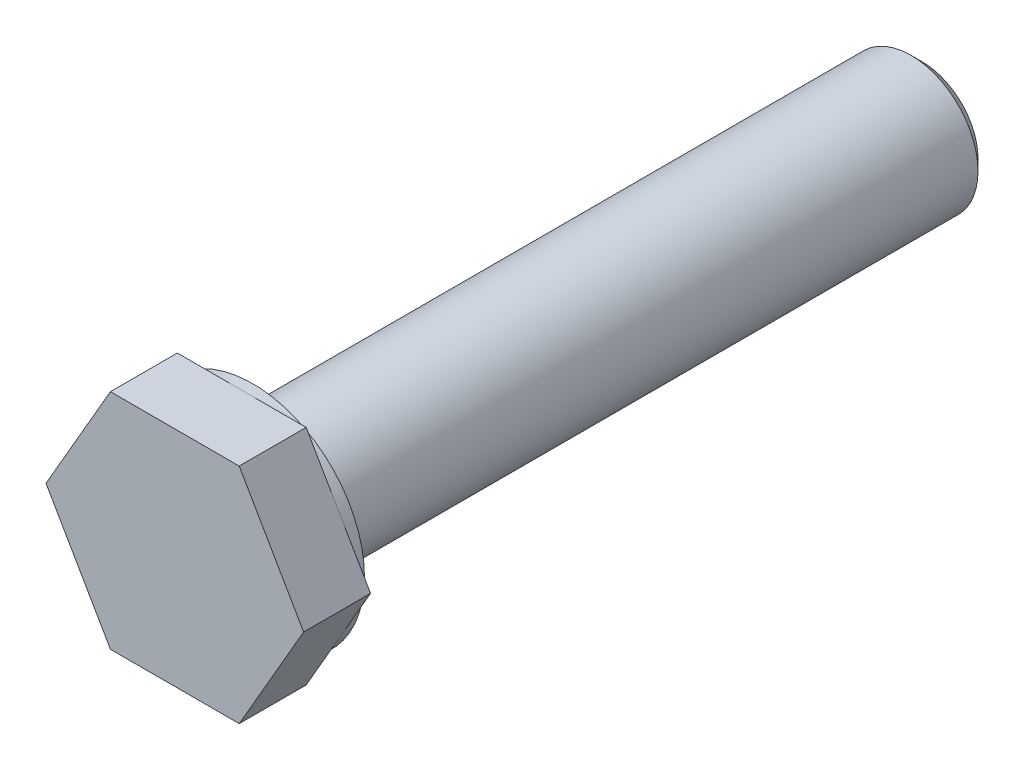
ISO-10303-21;
HEADER;
FILE_DESCRIPTION(('STEP AP214'),'2;1');
FILE_NAME('part.step','',(''),(''),'','','');
FILE_SCHEMA(('AUTOMOTIVE_DESIGN { 1 0 10303 214 1 1 1 1 }'));
ENDSEC;
DATA;
#1=APPLICATION_CONTEXT('core data for automotive mechanical design processes');
#2=APPLICATION_PROTOCOL_DEFINITION('international standard','automotive_design',2000,#1);
#3=PRODUCT_CONTEXT('',#1,'mechanical');
#4=PRODUCT('Part','Part','',(#3));
#5=PRODUCT_RELATED_PRODUCT_CATEGORY('part','',(#4));
#6=PRODUCT_DEFINITION_FORMATION('','',#4);
#7=PRODUCT_DEFINITION_CONTEXT('part definition',#1,'design');
#8=PRODUCT_DEFINITION('design','',#6,#7);
#9=PRODUCT_DEFINITION_SHAPE('','',#8);
#10=(LENGTH_UNIT() NAMED_UNIT(*) SI_UNIT(.MILLI.,.METRE.));
#11=(NAMED_UNIT(*) PLANE_ANGLE_UNIT() SI_UNIT($,.RADIAN.));
#12=(NAMED_UNIT(*) SI_UNIT($,.STERADIAN.) SOLID_ANGLE_UNIT());
#13=UNCERTAINTY_MEASURE_WITH_UNIT(LENGTH_MEASURE(1.E-05),#10,'distance_accuracy_value','');
#14=(GEOMETRIC_REPRESENTATION_CONTEXT(3) GLOBAL_UNCERTAINTY_ASSIGNED_CONTEXT((#13)) GLOBAL_UNIT_ASSIGNED_CONTEXT((#10,
#11,#12)) REPRESENTATION_CONTEXT('',''));
#15=CARTESIAN_POINT('',(0.,0.,0.));
#16=DIRECTION('',(0.,0.,1.));
#17=DIRECTION('',(1.,0.,0.));
#18=AXIS2_PLACEMENT_3D('',#15,#16,#17);
#19=CARTESIAN_POINT('',(0.,0.,30.));
#20=DIRECTION('',(0.,0.,-1.));
#21=DIRECTION('',(-1.,0.,0.));
#22=AXIS2_PLACEMENT_3D('',#19,#20,#21);
#23=CYLINDRICAL_SURFACE('',#22,3.);
#24=CARTESIAN_POINT('',(0.,0.,29.75));
#25=DIRECTION('',(0.,0.,1.));
#26=DIRECTION('',(1.,0.,0.));
#27=AXIS2_PLACEMENT_3D('',#24,#25,#26);
#28=CIRCLE('',#27,3.);
#29=CARTESIAN_POINT('',(3.,0.,29.75));
#30=VERTEX_POINT('',#29);
#31=EDGE_CURVE('E11',#30,#30,#28,.F.);
#32=ORIENTED_EDGE('',*,*,#31,.T.);
#33=EDGE_LOOP('',(#32));
#34=FACE_BOUND('',#33,.T.);
#35=CARTESIAN_POINT('',(0.,0.,0.5));
#36=DIRECTION('',(0.,0.,1.));
#37=DIRECTION('',(1.,0.,0.));
#38=AXIS2_PLACEMENT_3D('',#35,#36,#37);
#39=CIRCLE('',#38,3.);
#40=CARTESIAN_POINT('',(3.,0.,0.5));
#41=VERTEX_POINT('',#40);
#42=EDGE_CURVE('E155',#41,#41,#39,.T.);
#43=ORIENTED_EDGE('',*,*,#42,.T.);
#44=EDGE_LOOP('',(#43));
#45=FACE_BOUND('',#44,.T.);
#46=ADVANCED_FACE('F41',(#34,#45),#23,.T.);
#47=CARTESIAN_POINT('',(0.,0.,0.));
#48=DIRECTION('',(0.,0.,1.));
#49=DIRECTION('',(1.,0.,0.));
#50=AXIS2_PLACEMENT_3D('',#47,#48,#49);
#51=PLANE('',#50);
#52=CARTESIAN_POINT('',(0.,0.,0.));
#53=DIRECTION('',(0.,0.,1.));
#54=DIRECTION('',(1.,0.,0.));
#55=AXIS2_PLACEMENT_3D('',#52,#53,#54);
#56=CIRCLE('',#55,2.5);
#57=CARTESIAN_POINT('',(2.5,0.,0.));
#58=VERTEX_POINT('',#57);
#59=EDGE_CURVE('E161',#58,#58,#56,.F.);
#60=ORIENTED_EDGE('',*,*,#59,.T.);
#61=EDGE_LOOP('',(#60));
#62=FACE_BOUND('',#61,.T.);
#63=ADVANCED_FACE('F180',(#62),#51,.F.);
#64=CARTESIAN_POINT('',(0.,0.,30.5));
#65=DIRECTION('',(0.,0.,-1.));
#66=DIRECTION('',(-1.,0.,0.));
#67=AXIS2_PLACEMENT_3D('',#64,#65,#66);
#68=CYLINDRICAL_SURFACE('',#67,5.);
#69=CARTESIAN_POINT('',(0.,0.,30.5));
#70=DIRECTION('',(0.,0.,1.));
#71=DIRECTION('',(1.,0.,0.));
#72=AXIS2_PLACEMENT_3D('',#69,#70,#71);
#73=CIRCLE('',#72,5.);
#74=CARTESIAN_POINT('',(4.33012701892219,2.5,30.5));
#75=VERTEX_POINT('',#74);
#76=CARTESIAN_POINT('',(0.,5.,30.5));
#77=VERTEX_POINT('',#76);
#78=EDGE_CURVE('E152',#75,#77,#73,.T.);
#79=ORIENTED_EDGE('',*,*,#78,.F.);
#80=CARTESIAN_POINT('',(4.33012701892219,-2.5,30.5));
#81=VERTEX_POINT('',#80);
#82=EDGE_CURVE('E58',#81,#75,#73,.T.);
#83=ORIENTED_EDGE('',*,*,#82,.F.);
#84=CARTESIAN_POINT('',(0.,-5.,30.5));
#85=VERTEX_POINT('',#84);
#86=EDGE_CURVE('E62',#85,#81,#73,.T.);
#87=ORIENTED_EDGE('',*,*,#86,.F.);
#88=CARTESIAN_POINT('',(-4.3301270189222,-2.5,30.5));
#89=VERTEX_POINT('',#88);
#90=EDGE_CURVE('E421',#89,#85,#73,.T.);
#91=ORIENTED_EDGE('',*,*,#90,.F.);
#92=CARTESIAN_POINT('',(-4.3301270189222,2.5,30.5));
#93=VERTEX_POINT('',#92);
#94=EDGE_CURVE('E399',#93,#89,#73,.T.);
#95=ORIENTED_EDGE('',*,*,#94,.F.);
#96=EDGE_CURVE('E156',#77,#93,#73,.T.);
#97=ORIENTED_EDGE('',*,*,#96,.F.);
#98=EDGE_LOOP('',(#79,#83,#87,#91,#95,#97));
#99=FACE_BOUND('',#98,.T.);
#100=CARTESIAN_POINT('',(0.,0.,30.));
#101=DIRECTION('',(0.,0.,1.));
#102=DIRECTION('',(1.,0.,0.));
#103=AXIS2_PLACEMENT_3D('',#100,#101,#102);
#104=CIRCLE('',#103,5.);
#105=CARTESIAN_POINT('',(5.,0.,30.));
#106=VERTEX_POINT('',#105);
#107=EDGE_CURVE('E142',#106,#106,#104,.T.);
#108=ORIENTED_EDGE('',*,*,#107,.T.);
#109=EDGE_LOOP('',(#108));
#110=FACE_BOUND('',#109,.T.);
#111=ADVANCED_FACE('F186',(#99,#110),#68,.T.);
#112=CARTESIAN_POINT('',(0.,0.,30.));
#113=DIRECTION('',(0.,0.,1.));
#114=DIRECTION('',(1.,0.,0.));
#115=AXIS2_PLACEMENT_3D('',#112,#113,#114);
#116=PLANE('',#115);
#117=CARTESIAN_POINT('',(0.,0.,30.));
#118=DIRECTION('',(0.,0.,1.));
#119=DIRECTION('',(1.,0.,0.));
#120=AXIS2_PLACEMENT_3D('',#117,#118,#119);
#121=CIRCLE('',#120,3.25000000000001);
#122=CARTESIAN_POINT('',(3.25000000000001,0.,30.));
#123=VERTEX_POINT('',#122);
#124=EDGE_CURVE('E51',#123,#123,#121,.T.);
#125=ORIENTED_EDGE('',*,*,#124,.T.);
#126=EDGE_LOOP('',(#125));
#127=FACE_BOUND('',#126,.T.);
#128=ORIENTED_EDGE('',*,*,#107,.F.);
#129=EDGE_LOOP('',(#128));
#130=FACE_BOUND('',#129,.T.);
#131=ADVANCED_FACE('F168',(#127,#130),#116,.F.);
#132=CARTESIAN_POINT('',(0.,0.,30.5));
#133=DIRECTION('',(0.,0.,1.));
#134=DIRECTION('',(1.,0.,0.));
#135=AXIS2_PLACEMENT_3D('',#132,#133,#134);
#136=PLANE('',#135);
#137=DIRECTION('',(-0.5,0.866025403784438,0.));
#138=VECTOR('',#137,1.);
#139=CARTESIAN_POINT('',(5.77350269189626,0.,30.5));
#140=LINE('',#139,#138);
#141=CARTESIAN_POINT('',(2.88675134594813,5.,30.5));
#142=VERTEX_POINT('',#141);
#143=EDGE_CURVE('E353',#75,#142,#140,.T.);
#144=ORIENTED_EDGE('',*,*,#143,.F.);
#145=ORIENTED_EDGE('',*,*,#78,.T.);
#146=DIRECTION('',(-1.,0.,0.));
#147=VECTOR('',#146,1.);
#148=CARTESIAN_POINT('',(2.88675134594813,5.,30.5));
#149=LINE('',#148,#147);
#150=EDGE_CURVE('E361',#142,#77,#149,.T.);
#151=ORIENTED_EDGE('',*,*,#150,.F.);
#152=EDGE_LOOP('',(#144,#145,#151));
#153=FACE_BOUND('',#152,.T.);
#154=ADVANCED_FACE('F200',(#153),#136,.F.);
#155=CARTESIAN_POINT('',(-2.88675134594813,5.,30.5));
#156=VERTEX_POINT('',#155);
#157=EDGE_CURVE('E360',#77,#156,#149,.T.);
#158=ORIENTED_EDGE('',*,*,#157,.F.);
#159=ORIENTED_EDGE('',*,*,#96,.T.);
#160=DIRECTION('',(-0.5,-0.866025403784439,0.));
#161=VECTOR('',#160,1.);
#162=CARTESIAN_POINT('',(-2.88675134594813,5.,30.5));
#163=LINE('',#162,#161);
#164=EDGE_CURVE('E366',#156,#93,#163,.T.);
#165=ORIENTED_EDGE('',*,*,#164,.F.);
#166=EDGE_LOOP('',(#158,#159,#165));
#167=FACE_BOUND('',#166,.T.);
#168=ADVANCED_FACE('F224',(#167),#136,.F.);
#169=CARTESIAN_POINT('',(-5.77350269189626,0.,30.5));
#170=VERTEX_POINT('',#169);
#171=EDGE_CURVE('E365',#93,#170,#163,.T.);
#172=ORIENTED_EDGE('',*,*,#171,.F.);
#173=ORIENTED_EDGE('',*,*,#94,.T.);
#174=DIRECTION('',(0.5,-0.866025403784439,0.));
#175=VECTOR('',#174,1.);
#176=CARTESIAN_POINT('',(-5.77350269189626,0.,30.5));
#177=LINE('',#176,#175);
#178=EDGE_CURVE('E371',#170,#89,#177,.T.);
#179=ORIENTED_EDGE('',*,*,#178,.F.);
#180=EDGE_LOOP('',(#172,#173,#179));
#181=FACE_BOUND('',#180,.T.);
#182=ADVANCED_FACE('F267',(#181),#136,.F.);
#183=CARTESIAN_POINT('',(-2.88675134594813,-5.,30.5));
#184=VERTEX_POINT('',#183);
#185=EDGE_CURVE('E370',#89,#184,#177,.T.);
#186=ORIENTED_EDGE('',*,*,#185,.F.);
#187=ORIENTED_EDGE('',*,*,#90,.T.);
#188=DIRECTION('',(1.,0.,0.));
#189=VECTOR('',#188,1.);
#190=CARTESIAN_POINT('',(-2.88675134594813,-5.,30.5));
#191=LINE('',#190,#189);
#192=EDGE_CURVE('E134',#184,#85,#191,.T.);
#193=ORIENTED_EDGE('',*,*,#192,.F.);
#194=EDGE_LOOP('',(#186,#187,#193));
#195=FACE_BOUND('',#194,.T.);
#196=ADVANCED_FACE('F274',(#195),#136,.F.);
#197=CARTESIAN_POINT('',(2.88675134594813,-5.,30.5));
#198=VERTEX_POINT('',#197);
#199=EDGE_CURVE('E375',#85,#198,#191,.T.);
#200=ORIENTED_EDGE('',*,*,#199,.F.);
#201=ORIENTED_EDGE('',*,*,#86,.T.);
#202=DIRECTION('',(0.5,0.866025403784439,0.));
#203=VECTOR('',#202,1.);
#204=CARTESIAN_POINT('',(2.88675134594813,-5.,30.5));
#205=LINE('',#204,#203);
#206=EDGE_CURVE('E347',#198,#81,#205,.T.);
#207=ORIENTED_EDGE('',*,*,#206,.F.);
#208=EDGE_LOOP('',(#200,#201,#207));
#209=FACE_BOUND('',#208,.T.);
#210=ADVANCED_FACE('F281',(#209),#136,.F.);
#211=CARTESIAN_POINT('',(5.77350269189626,0.,30.5));
#212=VERTEX_POINT('',#211);
#213=EDGE_CURVE('E139',#81,#212,#205,.T.);
#214=ORIENTED_EDGE('',*,*,#213,.F.);
#215=ORIENTED_EDGE('',*,*,#82,.T.);
#216=EDGE_CURVE('E345',#212,#75,#140,.T.);
#217=ORIENTED_EDGE('',*,*,#216,.F.);
#218=EDGE_LOOP('',(#214,#215,#217));
#219=FACE_BOUND('',#218,.T.);
#220=ADVANCED_FACE('F203',(#219),#136,.F.);
#221=CARTESIAN_POINT('',(2.88675134594813,-5.,33.5));
#222=DIRECTION('',(-0.866025403784439,0.5,0.));
#223=DIRECTION('',(-0.5,-0.866025403784439,0.));
#224=AXIS2_PLACEMENT_3D('',#221,#222,#223);
#225=PLANE('',#224);
#226=ORIENTED_EDGE('',*,*,#206,.T.);
#227=ORIENTED_EDGE('',*,*,#213,.T.);
#228=DIRECTION('',(0.,0.,-1.));
#229=VECTOR('',#228,1.);
#230=CARTESIAN_POINT('',(5.77350269189626,0.,33.5));
#231=LINE('',#230,#229);
#232=CARTESIAN_POINT('',(5.77350269189626,0.,33.5));
#233=VERTEX_POINT('',#232);
#234=EDGE_CURVE('E117',#233,#212,#231,.T.);
#235=ORIENTED_EDGE('',*,*,#234,.F.);
#236=DIRECTION('',(0.5,0.866025403784439,0.));
#237=VECTOR('',#236,1.);
#238=CARTESIAN_POINT('',(2.88675134594813,-5.,33.5));
#239=LINE('',#238,#237);
#240=CARTESIAN_POINT('',(2.88675134594813,-5.,33.5));
#241=VERTEX_POINT('',#240);
#242=EDGE_CURVE('E124',#241,#233,#239,.T.);
#243=ORIENTED_EDGE('',*,*,#242,.F.);
#244=DIRECTION('',(0.,0.,-1.));
#245=VECTOR('',#244,1.);
#246=CARTESIAN_POINT('',(2.88675134594813,-5.,33.5));
#247=LINE('',#246,#245);
#248=EDGE_CURVE('E350',#241,#198,#247,.T.);
#249=ORIENTED_EDGE('',*,*,#248,.T.);
#250=EDGE_LOOP('',(#226,#227,#235,#243,#249));
#251=FACE_BOUND('',#250,.T.);
#252=ADVANCED_FACE('F137',(#251),#225,.F.);
#253=CARTESIAN_POINT('',(5.77350269189626,0.,33.5));
#254=DIRECTION('',(-0.866025403784439,-0.5,0.));
#255=DIRECTION('',(0.5,-0.866025403784439,0.));
#256=AXIS2_PLACEMENT_3D('',#253,#254,#255);
#257=PLANE('',#256);
#258=ORIENTED_EDGE('',*,*,#216,.T.);
#259=ORIENTED_EDGE('',*,*,#143,.T.);
#260=DIRECTION('',(0.,0.,-1.));
#261=VECTOR('',#260,1.);
#262=CARTESIAN_POINT('',(2.88675134594813,5.,33.5));
#263=LINE('',#262,#261);
#264=CARTESIAN_POINT('',(2.88675134594813,5.,33.5));
#265=VERTEX_POINT('',#264);
#266=EDGE_CURVE('E119',#265,#142,#263,.T.);
#267=ORIENTED_EDGE('',*,*,#266,.F.);
#268=DIRECTION('',(-0.5,0.866025403784438,0.));
#269=VECTOR('',#268,1.);
#270=CARTESIAN_POINT('',(5.77350269189626,0.,33.5));
#271=LINE('',#270,#269);
#272=EDGE_CURVE('E112',#233,#265,#271,.T.);
#273=ORIENTED_EDGE('',*,*,#272,.F.);
#274=ORIENTED_EDGE('',*,*,#234,.T.);
#275=EDGE_LOOP('',(#258,#259,#267,#273,#274));
#276=FACE_BOUND('',#275,.T.);
#277=ADVANCED_FACE('F115',(#276),#257,.F.);
#278=CARTESIAN_POINT('',(2.88675134594813,5.,33.5));
#279=DIRECTION('',(0.,-1.,0.));
#280=DIRECTION('',(0.,0.,-1.));
#281=AXIS2_PLACEMENT_3D('',#278,#279,#280);
#282=PLANE('',#281);
#283=ORIENTED_EDGE('',*,*,#150,.T.);
#284=ORIENTED_EDGE('',*,*,#157,.T.);
#285=DIRECTION('',(0.,0.,-1.));
#286=VECTOR('',#285,1.);
#287=CARTESIAN_POINT('',(-2.88675134594813,5.,33.5));
#288=LINE('',#287,#286);
#289=CARTESIAN_POINT('',(-2.88675134594813,5.,33.5));
#290=VERTEX_POINT('',#289);
#291=EDGE_CURVE('E148',#290,#156,#288,.T.);
#292=ORIENTED_EDGE('',*,*,#291,.F.);
#293=DIRECTION('',(-1.,0.,0.));
#294=VECTOR('',#293,1.);
#295=CARTESIAN_POINT('',(2.88675134594813,5.,33.5));
#296=LINE('',#295,#294);
#297=EDGE_CURVE('E123',#265,#290,#296,.T.);
#298=ORIENTED_EDGE('',*,*,#297,.F.);
#299=ORIENTED_EDGE('',*,*,#266,.T.);
#300=EDGE_LOOP('',(#283,#284,#292,#298,#299));
#301=FACE_BOUND('',#300,.T.);
#302=ADVANCED_FACE('F206',(#301),#282,.F.);
#303=CARTESIAN_POINT('',(-2.88675134594813,5.,33.5));
#304=DIRECTION('',(0.866025403784439,-0.5,0.));
#305=DIRECTION('',(0.5,0.866025403784439,0.));
#306=AXIS2_PLACEMENT_3D('',#303,#304,#305);
#307=PLANE('',#306);
#308=ORIENTED_EDGE('',*,*,#164,.T.);
#309=ORIENTED_EDGE('',*,*,#171,.T.);
#310=DIRECTION('',(0.,0.,-1.));
#311=VECTOR('',#310,1.);
#312=CARTESIAN_POINT('',(-5.77350269189626,0.,33.5));
#313=LINE('',#312,#311);
#314=CARTESIAN_POINT('',(-5.77350269189626,0.,33.5));
#315=VERTEX_POINT('',#314);
#316=EDGE_CURVE('E385',#315,#170,#313,.T.);
#317=ORIENTED_EDGE('',*,*,#316,.F.);
#318=DIRECTION('',(-0.5,-0.866025403784439,0.));
#319=VECTOR('',#318,1.);
#320=CARTESIAN_POINT('',(-2.88675134594813,5.,33.5));
#321=LINE('',#320,#319);
#322=EDGE_CURVE('E394',#290,#315,#321,.T.);
#323=ORIENTED_EDGE('',*,*,#322,.F.);
#324=ORIENTED_EDGE('',*,*,#291,.T.);
#325=EDGE_LOOP('',(#308,#309,#317,#323,#324));
#326=FACE_BOUND('',#325,.T.);
#327=ADVANCED_FACE('F209',(#326),#307,.F.);
#328=CARTESIAN_POINT('',(-5.77350269189626,0.,33.5));
#329=DIRECTION('',(0.866025403784439,0.5,0.));
#330=DIRECTION('',(-0.5,0.866025403784439,0.));
#331=AXIS2_PLACEMENT_3D('',#328,#329,#330);
#332=PLANE('',#331);
#333=ORIENTED_EDGE('',*,*,#178,.T.);
#334=ORIENTED_EDGE('',*,*,#185,.T.);
#335=DIRECTION('',(0.,0.,-1.));
#336=VECTOR('',#335,1.);
#337=CARTESIAN_POINT('',(-2.88675134594813,-5.,33.5));
#338=LINE('',#337,#336);
#339=CARTESIAN_POINT('',(-2.88675134594813,-5.,33.5));
#340=VERTEX_POINT('',#339);
#341=EDGE_CURVE('E381',#340,#184,#338,.T.);
#342=ORIENTED_EDGE('',*,*,#341,.F.);
#343=DIRECTION('',(0.5,-0.866025403784439,0.));
#344=VECTOR('',#343,1.);
#345=CARTESIAN_POINT('',(-5.77350269189626,0.,33.5));
#346=LINE('',#345,#344);
#347=EDGE_CURVE('E412',#315,#340,#346,.T.);
#348=ORIENTED_EDGE('',*,*,#347,.F.);
#349=ORIENTED_EDGE('',*,*,#316,.T.);
#350=EDGE_LOOP('',(#333,#334,#342,#348,#349));
#351=FACE_BOUND('',#350,.T.);
#352=ADVANCED_FACE('F213',(#351),#332,.F.);
#353=CARTESIAN_POINT('',(-2.88675134594813,-5.,33.5));
#354=DIRECTION('',(0.,1.,0.));
#355=DIRECTION('',(-1.,0.,0.));
#356=AXIS2_PLACEMENT_3D('',#353,#354,#355);
#357=PLANE('',#356);
#358=ORIENTED_EDGE('',*,*,#192,.T.);
#359=ORIENTED_EDGE('',*,*,#199,.T.);
#360=ORIENTED_EDGE('',*,*,#248,.F.);
#361=DIRECTION('',(1.,0.,0.));
#362=VECTOR('',#361,1.);
#363=CARTESIAN_POINT('',(-2.88675134594813,-5.,33.5));
#364=LINE('',#363,#362);
#365=EDGE_CURVE('E129',#340,#241,#364,.T.);
#366=ORIENTED_EDGE('',*,*,#365,.F.);
#367=ORIENTED_EDGE('',*,*,#341,.T.);
#368=EDGE_LOOP('',(#358,#359,#360,#366,#367));
#369=FACE_BOUND('',#368,.T.);
#370=ADVANCED_FACE('F217',(#369),#357,.F.);
#371=CARTESIAN_POINT('',(0.,0.,33.5));
#372=DIRECTION('',(0.,0.,1.));
#373=DIRECTION('',(1.,0.,0.));
#374=AXIS2_PLACEMENT_3D('',#371,#372,#373);
#375=PLANE('',#374);
#376=ORIENTED_EDGE('',*,*,#242,.T.);
#377=ORIENTED_EDGE('',*,*,#272,.T.);
#378=ORIENTED_EDGE('',*,*,#297,.T.);
#379=ORIENTED_EDGE('',*,*,#322,.T.);
#380=ORIENTED_EDGE('',*,*,#347,.T.);
#381=ORIENTED_EDGE('',*,*,#365,.T.);
#382=EDGE_LOOP('',(#376,#377,#378,#379,#380,#381));
#383=FACE_BOUND('',#382,.T.);
#384=ADVANCED_FACE('F127',(#383),#375,.T.);
#385=CARTESIAN_POINT('',(0.,0.,0.5));
#386=DIRECTION('',(0.,0.,1.));
#387=DIRECTION('',(1.,0.,0.));
#388=AXIS2_PLACEMENT_3D('',#385,#386,#387);
#389=CONICAL_SURFACE('',#388,3.,0.785398163397453);
#390=ORIENTED_EDGE('',*,*,#59,.F.);
#391=EDGE_LOOP('',(#390));
#392=FACE_BOUND('',#391,.T.);
#393=ORIENTED_EDGE('',*,*,#42,.F.);
#394=EDGE_LOOP('',(#393));
#395=FACE_BOUND('',#394,.T.);
#396=ADVANCED_FACE('F172',(#392,#395),#389,.T.);
#397=CARTESIAN_POINT('',(0.,0.,30.));
#398=DIRECTION('',(0.,0.,1.));
#399=DIRECTION('',(1.,0.,0.));
#400=AXIS2_PLACEMENT_3D('',#397,#398,#399);
#401=CONICAL_SURFACE('',#400,3.25000000000001,0.78539816339746);
#402=ORIENTED_EDGE('',*,*,#31,.F.);
#403=EDGE_LOOP('',(#402));
#404=FACE_BOUND('',#403,.T.);
#405=ORIENTED_EDGE('',*,*,#124,.F.);
#406=EDGE_LOOP('',(#405));
#407=FACE_BOUND('',#406,.T.);
#408=ADVANCED_FACE('F44',(#404,#407),#401,.T.);
#409=CLOSED_SHELL('',(#46,#63,#111,#131,#154,#168,#182,#196,#210,#220,#252,#277,#302,#327,#352,
#370,#384,#396,#408));
#410=MANIFOLD_SOLID_BREP('B2',#409);
#411=ADVANCED_BREP_SHAPE_REPRESENTATION('',(#18,#410),#14);
#412=SHAPE_DEFINITION_REPRESENTATION(#9,#411);
ENDSEC;
END-ISO-10303-21;
